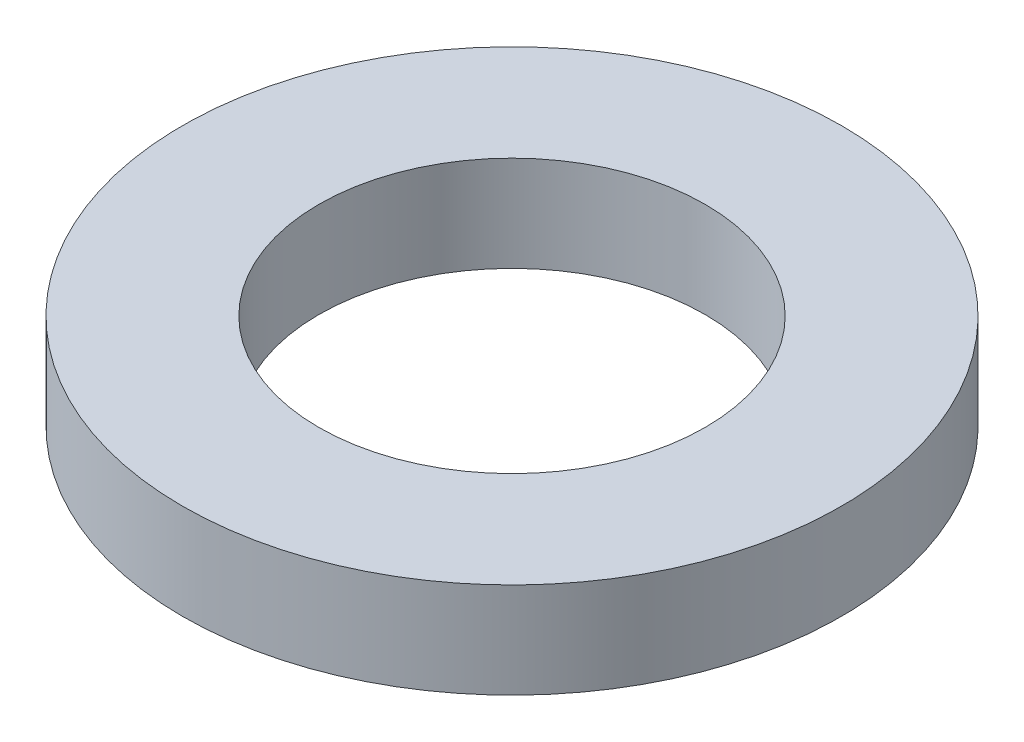
ISO-10303-21;
HEADER;
FILE_DESCRIPTION(('STEP AP214'),'2;1');
FILE_NAME('part.step','',(''),(''),'','','');
FILE_SCHEMA(('AUTOMOTIVE_DESIGN { 1 0 10303 214 1 1 1 1 }'));
ENDSEC;
DATA;
#1=APPLICATION_CONTEXT('core data for automotive mechanical design processes');
#2=APPLICATION_PROTOCOL_DEFINITION('international standard','automotive_design',2000,#1);
#3=PRODUCT_CONTEXT('',#1,'mechanical');
#4=PRODUCT('Part','Part','',(#3));
#5=PRODUCT_RELATED_PRODUCT_CATEGORY('part','',(#4));
#6=PRODUCT_DEFINITION_FORMATION('','',#4);
#7=PRODUCT_DEFINITION_CONTEXT('part definition',#1,'design');
#8=PRODUCT_DEFINITION('design','',#6,#7);
#9=PRODUCT_DEFINITION_SHAPE('','',#8);
#10=(LENGTH_UNIT() NAMED_UNIT(*) SI_UNIT(.MILLI.,.METRE.));
#11=(NAMED_UNIT(*) PLANE_ANGLE_UNIT() SI_UNIT($,.RADIAN.));
#12=(NAMED_UNIT(*) SI_UNIT($,.STERADIAN.) SOLID_ANGLE_UNIT());
#13=UNCERTAINTY_MEASURE_WITH_UNIT(LENGTH_MEASURE(1.E-05),#10,'distance_accuracy_value','');
#14=(GEOMETRIC_REPRESENTATION_CONTEXT(3) GLOBAL_UNCERTAINTY_ASSIGNED_CONTEXT((#13)) GLOBAL_UNIT_ASSIGNED_CONTEXT((#10,
#11,#12)) REPRESENTATION_CONTEXT('',''));
#15=CARTESIAN_POINT('',(0.,0.,0.));
#16=DIRECTION('',(0.,0.,1.));
#17=DIRECTION('',(1.,0.,0.));
#18=AXIS2_PLACEMENT_3D('',#15,#16,#17);
#19=CARTESIAN_POINT('',(0.,21.,0.));
#20=DIRECTION('',(0.,-1.,0.));
#21=DIRECTION('',(0.,0.,-1.));
#22=AXIS2_PLACEMENT_3D('',#19,#20,#21);
#23=CYLINDRICAL_SURFACE('',#22,72.5);
#24=CARTESIAN_POINT('',(0.,21.,0.));
#25=DIRECTION('',(0.,1.,0.));
#26=DIRECTION('',(0.,0.,1.));
#27=AXIS2_PLACEMENT_3D('',#24,#25,#26);
#28=CIRCLE('',#27,72.5);
#29=CARTESIAN_POINT('',(0.,21.,-72.5));
#30=VERTEX_POINT('',#29);
#31=EDGE_CURVE('E10',#30,#30,#28,.T.);
#32=CARTESIAN_POINT('',(0.,0.,0.));
#33=DIRECTION('',(0.,1.,0.));
#34=DIRECTION('',(0.,0.,1.));
#35=AXIS2_PLACEMENT_3D('',#32,#33,#34);
#36=CIRCLE('',#35,72.5);
#37=CARTESIAN_POINT('',(0.,0.,-72.5));
#38=VERTEX_POINT('',#37);
#39=EDGE_CURVE('E37',#38,#38,#36,.T.);
#40=CARTESIAN_POINT('',(0.,21.,-72.5));
#41=CARTESIAN_POINT('',(0.,20.78125,-72.5));
#42=CARTESIAN_POINT('',(0.,20.5625,-72.5));
#43=CARTESIAN_POINT('',(0.,20.125,-72.5));
#44=CARTESIAN_POINT('',(0.,19.90625,-72.5));
#45=CARTESIAN_POINT('',(0.,19.46875,-72.5));
#46=CARTESIAN_POINT('',(0.,19.25,-72.5));
#47=CARTESIAN_POINT('',(0.,18.8125,-72.5));
#48=CARTESIAN_POINT('',(0.,18.59375,-72.5));
#49=CARTESIAN_POINT('',(0.,18.15625,-72.5));
#50=CARTESIAN_POINT('',(0.,17.9375,-72.5));
#51=CARTESIAN_POINT('',(0.,17.5,-72.5));
#52=CARTESIAN_POINT('',(0.,17.28125,-72.5));
#53=CARTESIAN_POINT('',(0.,16.84375,-72.5));
#54=CARTESIAN_POINT('',(0.,16.625,-72.5));
#55=CARTESIAN_POINT('',(0.,16.1875,-72.5));
#56=CARTESIAN_POINT('',(0.,15.96875,-72.5));
#57=CARTESIAN_POINT('',(0.,15.53125,-72.5));
#58=CARTESIAN_POINT('',(0.,15.3125,-72.5));
#59=CARTESIAN_POINT('',(0.,14.875,-72.5));
#60=CARTESIAN_POINT('',(0.,14.65625,-72.5));
#61=CARTESIAN_POINT('',(0.,14.21875,-72.5));
#62=CARTESIAN_POINT('',(0.,14.,-72.5));
#63=CARTESIAN_POINT('',(0.,13.5625,-72.5));
#64=CARTESIAN_POINT('',(0.,13.34375,-72.5));
#65=CARTESIAN_POINT('',(0.,12.90625,-72.5));
#66=CARTESIAN_POINT('',(0.,12.6875,-72.5));
#67=CARTESIAN_POINT('',(0.,12.25,-72.5));
#68=CARTESIAN_POINT('',(0.,12.03125,-72.5));
#69=CARTESIAN_POINT('',(0.,11.59375,-72.5));
#70=CARTESIAN_POINT('',(0.,11.375,-72.5));
#71=CARTESIAN_POINT('',(0.,10.9375,-72.5));
#72=CARTESIAN_POINT('',(0.,10.71875,-72.5));
#73=CARTESIAN_POINT('',(0.,10.28125,-72.5));
#74=CARTESIAN_POINT('',(0.,10.0625,-72.5));
#75=CARTESIAN_POINT('',(0.,9.625,-72.5));
#76=CARTESIAN_POINT('',(0.,9.40625,-72.5));
#77=CARTESIAN_POINT('',(0.,8.96875,-72.5));
#78=CARTESIAN_POINT('',(0.,8.75,-72.5));
#79=CARTESIAN_POINT('',(0.,8.3125,-72.5));
#80=CARTESIAN_POINT('',(0.,8.09375,-72.5));
#81=CARTESIAN_POINT('',(0.,7.65625,-72.5));
#82=CARTESIAN_POINT('',(0.,7.4375,-72.5));
#83=CARTESIAN_POINT('',(0.,7.,-72.5));
#84=CARTESIAN_POINT('',(0.,6.78125,-72.5));
#85=CARTESIAN_POINT('',(0.,6.34375,-72.5));
#86=CARTESIAN_POINT('',(0.,6.125,-72.5));
#87=CARTESIAN_POINT('',(0.,5.6875,-72.5));
#88=CARTESIAN_POINT('',(0.,5.46875,-72.5));
#89=CARTESIAN_POINT('',(0.,5.03125,-72.5));
#90=CARTESIAN_POINT('',(0.,4.8125,-72.5));
#91=CARTESIAN_POINT('',(0.,4.375,-72.5));
#92=CARTESIAN_POINT('',(0.,4.15625,-72.5));
#93=CARTESIAN_POINT('',(0.,3.71875,-72.5));
#94=CARTESIAN_POINT('',(0.,3.5,-72.5));
#95=CARTESIAN_POINT('',(0.,3.0625,-72.5));
#96=CARTESIAN_POINT('',(0.,2.84375,-72.5));
#97=CARTESIAN_POINT('',(0.,2.40625,-72.5));
#98=CARTESIAN_POINT('',(0.,2.1875,-72.5));
#99=CARTESIAN_POINT('',(0.,1.75,-72.5));
#100=CARTESIAN_POINT('',(0.,1.53125,-72.5));
#101=CARTESIAN_POINT('',(0.,1.09375,-72.5));
#102=CARTESIAN_POINT('',(0.,0.875000000000001,-72.5));
#103=CARTESIAN_POINT('',(0.,0.4375,-72.5));
#104=CARTESIAN_POINT('',(0.,0.21875,-72.5));
#105=CARTESIAN_POINT('',(0.,0.,-72.5));
#106=B_SPLINE_CURVE_WITH_KNOTS('',3,(#40,#41,#42,#43,#44,#45,#46,#47,#48,#49,#50,#51,#52,#53,
#54,#55,#56,#57,#58,#59,#60,#61,#62,#63,#64,#65,#66,#67,#68,#69,#70,#71,#72,#73,#74,#75,#76,#77,
#78,#79,#80,#81,#82,#83,#84,#85,#86,#87,#88,#89,#90,#91,#92,#93,#94,#95,#96,#97,#98,#99,#100,
#101,#102,#103,#104,#105),.UNSPECIFIED.,.F.,.F.,(4,2,2,2,2,2,2,2,2,2,2,2,2,2,2,2,2,2,2,2,2,2,2,
2,2,2,2,2,2,2,2,2,4),(0.,0.656249999999997,1.3125,1.96875,2.625,3.28125,3.9375,4.59375,5.25,
5.90625,6.5625,7.21875,7.875,8.53125,9.1875,9.84375,10.5,11.15625,11.8125,12.46875,13.125,
13.78125,14.4375,15.09375,15.75,16.40625,17.0625,17.71875,18.375,19.03125,19.6875,20.34375,21.),.UNSPECIFIED.);
#107=EDGE_CURVE('BSEAM40',#30,#38,#106,.T.);
#108=ORIENTED_EDGE('',*,*,#31,.F.);
#109=ORIENTED_EDGE('',*,*,#39,.T.);
#110=ORIENTED_EDGE('',*,*,#107,.T.);
#111=ORIENTED_EDGE('',*,*,#107,.F.);
#112=EDGE_LOOP('',(#108,#110,#109,#111));
#113=FACE_BOUND('',#112,.T.);
#114=ADVANCED_FACE('F40',(#113),#23,.T.);
#115=CARTESIAN_POINT('',(0.,21.,0.));
#116=DIRECTION('',(0.,1.,0.));
#117=DIRECTION('',(0.,0.,1.));
#118=AXIS2_PLACEMENT_3D('',#115,#116,#117);
#119=PLANE('',#118);
#120=CARTESIAN_POINT('',(0.,21.,0.));
#121=DIRECTION('',(0.,1.,0.));
#122=DIRECTION('',(0.,0.,1.));
#123=AXIS2_PLACEMENT_3D('',#120,#121,#122);
#124=CIRCLE('',#123,42.5);
#125=CARTESIAN_POINT('',(0.,21.,-42.5));
#126=VERTEX_POINT('',#125);
#127=EDGE_CURVE('E50',#126,#126,#124,.T.);
#128=ORIENTED_EDGE('',*,*,#127,.F.);
#129=EDGE_LOOP('',(#128));
#130=FACE_BOUND('',#129,.T.);
#131=ORIENTED_EDGE('',*,*,#31,.T.);
#132=EDGE_LOOP('',(#131));
#133=FACE_BOUND('',#132,.T.);
#134=ADVANCED_FACE('F59',(#130,#133),#119,.T.);
#135=CARTESIAN_POINT('',(0.,0.,0.));
#136=DIRECTION('',(0.,1.,0.));
#137=DIRECTION('',(0.,0.,1.));
#138=AXIS2_PLACEMENT_3D('',#135,#136,#137);
#139=PLANE('',#138);
#140=CARTESIAN_POINT('',(0.,0.,0.));
#141=DIRECTION('',(0.,1.,0.));
#142=DIRECTION('',(0.,0.,1.));
#143=AXIS2_PLACEMENT_3D('',#140,#141,#142);
#144=CIRCLE('',#143,42.5);
#145=CARTESIAN_POINT('',(0.,0.,-42.5));
#146=VERTEX_POINT('',#145);
#147=EDGE_CURVE('E47',#146,#146,#144,.T.);
#148=ORIENTED_EDGE('',*,*,#147,.T.);
#149=EDGE_LOOP('',(#148));
#150=FACE_BOUND('',#149,.T.);
#151=ORIENTED_EDGE('',*,*,#39,.F.);
#152=EDGE_LOOP('',(#151));
#153=FACE_BOUND('',#152,.T.);
#154=ADVANCED_FACE('F58',(#150,#153),#139,.F.);
#155=CARTESIAN_POINT('',(0.,21.,0.));
#156=DIRECTION('',(0.,-1.,0.));
#157=DIRECTION('',(0.,0.,-1.));
#158=AXIS2_PLACEMENT_3D('',#155,#156,#157);
#159=CYLINDRICAL_SURFACE('',#158,42.5);
#160=CARTESIAN_POINT('',(0.,21.,-42.5));
#161=CARTESIAN_POINT('',(0.,20.78125,-42.5));
#162=CARTESIAN_POINT('',(0.,20.5625,-42.5));
#163=CARTESIAN_POINT('',(0.,20.125,-42.5));
#164=CARTESIAN_POINT('',(0.,19.90625,-42.5));
#165=CARTESIAN_POINT('',(0.,19.46875,-42.5));
#166=CARTESIAN_POINT('',(0.,19.25,-42.5));
#167=CARTESIAN_POINT('',(0.,18.8125,-42.5));
#168=CARTESIAN_POINT('',(0.,18.59375,-42.5));
#169=CARTESIAN_POINT('',(0.,18.15625,-42.5));
#170=CARTESIAN_POINT('',(0.,17.9375,-42.5));
#171=CARTESIAN_POINT('',(0.,17.5,-42.5));
#172=CARTESIAN_POINT('',(0.,17.28125,-42.5));
#173=CARTESIAN_POINT('',(0.,16.84375,-42.5));
#174=CARTESIAN_POINT('',(0.,16.625,-42.5));
#175=CARTESIAN_POINT('',(0.,16.1875,-42.5));
#176=CARTESIAN_POINT('',(0.,15.96875,-42.5));
#177=CARTESIAN_POINT('',(0.,15.53125,-42.5));
#178=CARTESIAN_POINT('',(0.,15.3125,-42.5));
#179=CARTESIAN_POINT('',(0.,14.875,-42.5));
#180=CARTESIAN_POINT('',(0.,14.65625,-42.5));
#181=CARTESIAN_POINT('',(0.,14.21875,-42.5));
#182=CARTESIAN_POINT('',(0.,14.,-42.5));
#183=CARTESIAN_POINT('',(0.,13.5625,-42.5));
#184=CARTESIAN_POINT('',(0.,13.34375,-42.5));
#185=CARTESIAN_POINT('',(0.,12.90625,-42.5));
#186=CARTESIAN_POINT('',(0.,12.6875,-42.5));
#187=CARTESIAN_POINT('',(0.,12.25,-42.5));
#188=CARTESIAN_POINT('',(0.,12.03125,-42.5));
#189=CARTESIAN_POINT('',(0.,11.59375,-42.5));
#190=CARTESIAN_POINT('',(0.,11.375,-42.5));
#191=CARTESIAN_POINT('',(0.,10.9375,-42.5));
#192=CARTESIAN_POINT('',(0.,10.71875,-42.5));
#193=CARTESIAN_POINT('',(0.,10.28125,-42.5));
#194=CARTESIAN_POINT('',(0.,10.0625,-42.5));
#195=CARTESIAN_POINT('',(0.,9.625,-42.5));
#196=CARTESIAN_POINT('',(0.,9.40625,-42.5));
#197=CARTESIAN_POINT('',(0.,8.96875,-42.5));
#198=CARTESIAN_POINT('',(0.,8.75,-42.5));
#199=CARTESIAN_POINT('',(0.,8.3125,-42.5));
#200=CARTESIAN_POINT('',(0.,8.09375,-42.5));
#201=CARTESIAN_POINT('',(0.,7.65625,-42.5));
#202=CARTESIAN_POINT('',(0.,7.4375,-42.5));
#203=CARTESIAN_POINT('',(0.,7.,-42.5));
#204=CARTESIAN_POINT('',(0.,6.78125,-42.5));
#205=CARTESIAN_POINT('',(0.,6.34375,-42.5));
#206=CARTESIAN_POINT('',(0.,6.125,-42.5));
#207=CARTESIAN_POINT('',(0.,5.6875,-42.5));
#208=CARTESIAN_POINT('',(0.,5.46875,-42.5));
#209=CARTESIAN_POINT('',(0.,5.03125,-42.5));
#210=CARTESIAN_POINT('',(0.,4.8125,-42.5));
#211=CARTESIAN_POINT('',(0.,4.375,-42.5));
#212=CARTESIAN_POINT('',(0.,4.15625,-42.5));
#213=CARTESIAN_POINT('',(0.,3.71875,-42.5));
#214=CARTESIAN_POINT('',(0.,3.5,-42.5));
#215=CARTESIAN_POINT('',(0.,3.0625,-42.5));
#216=CARTESIAN_POINT('',(0.,2.84375,-42.5));
#217=CARTESIAN_POINT('',(0.,2.40625,-42.5));
#218=CARTESIAN_POINT('',(0.,2.1875,-42.5));
#219=CARTESIAN_POINT('',(0.,1.75,-42.5));
#220=CARTESIAN_POINT('',(0.,1.53125,-42.5));
#221=CARTESIAN_POINT('',(0.,1.09375,-42.5));
#222=CARTESIAN_POINT('',(0.,0.875000000000001,-42.5));
#223=CARTESIAN_POINT('',(0.,0.4375,-42.5));
#224=CARTESIAN_POINT('',(0.,0.21875,-42.5));
#225=CARTESIAN_POINT('',(0.,0.,-42.5));
#226=B_SPLINE_CURVE_WITH_KNOTS('',3,(#160,#161,#162,#163,#164,#165,#166,#167,#168,#169,#170,
#171,#172,#173,#174,#175,#176,#177,#178,#179,#180,#181,#182,#183,#184,#185,#186,#187,#188,#189,
#190,#191,#192,#193,#194,#195,#196,#197,#198,#199,#200,#201,#202,#203,#204,#205,#206,#207,#208,
#209,#210,#211,#212,#213,#214,#215,#216,#217,#218,#219,#220,#221,#222,#223,#224,#225),
.UNSPECIFIED.,.F.,.F.,(4,2,2,2,2,2,2,2,2,2,2,2,2,2,2,2,2,2,2,2,2,2,2,2,2,2,2,2,2,2,2,2,4),(0.,
0.656249999999997,1.3125,1.96875,2.625,3.28125,3.9375,4.59375,5.25,5.90625,6.5625,7.21875,7.875,
8.53125,9.1875,9.84375,10.5,11.15625,11.8125,12.46875,13.125,13.78125,14.4375,15.09375,15.75,
16.40625,17.0625,17.71875,18.375,19.03125,19.6875,20.34375,21.),.UNSPECIFIED.);
#227=EDGE_CURVE('BSEAM54',#126,#146,#226,.T.);
#228=ORIENTED_EDGE('',*,*,#127,.T.);
#229=ORIENTED_EDGE('',*,*,#147,.F.);
#230=ORIENTED_EDGE('',*,*,#227,.T.);
#231=ORIENTED_EDGE('',*,*,#227,.F.);
#232=EDGE_LOOP('',(#228,#230,#229,#231));
#233=FACE_BOUND('',#232,.T.);
#234=ADVANCED_FACE('F54',(#233),#159,.F.);
#235=CLOSED_SHELL('',(#114,#134,#154,#234));
#236=MANIFOLD_SOLID_BREP('B2',#235);
#237=ADVANCED_BREP_SHAPE_REPRESENTATION('',(#18,#236),#14);
#238=SHAPE_DEFINITION_REPRESENTATION(#9,#237);
ENDSEC;
END-ISO-10303-21;
